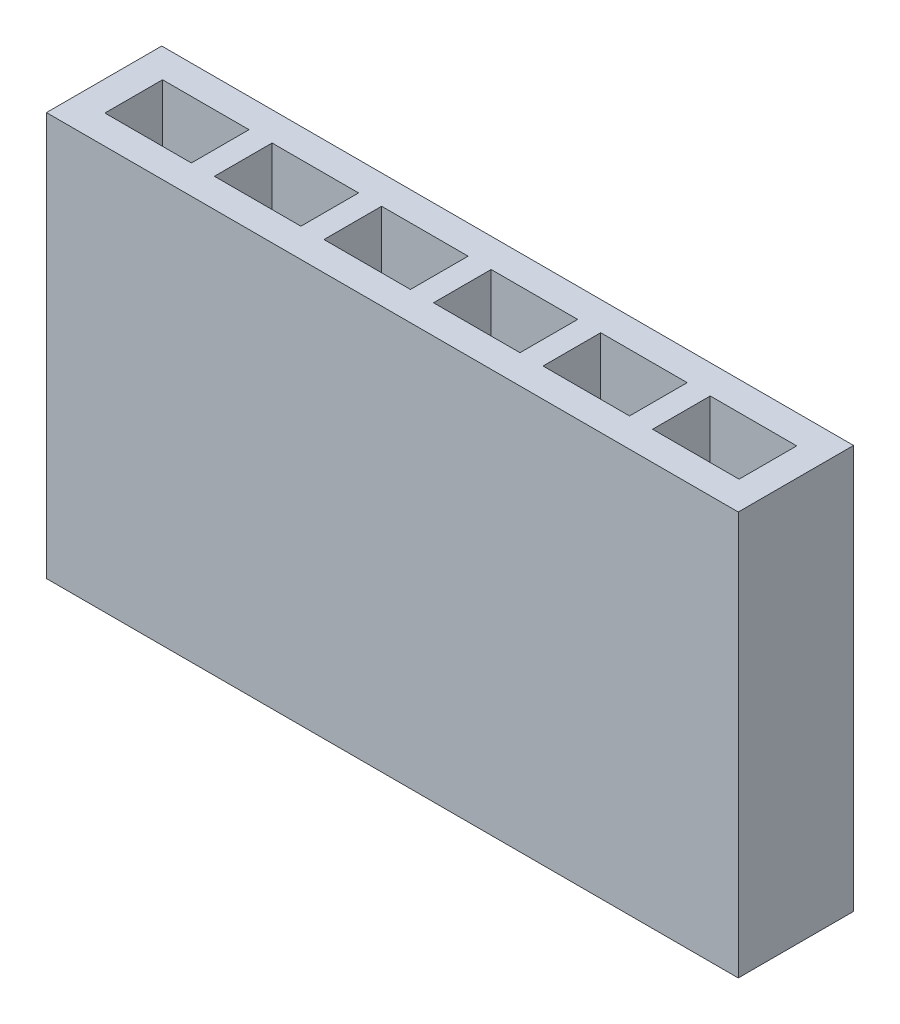
ISO-10303-21;
HEADER;
FILE_DESCRIPTION(('STEP AP214'),'2;1');
FILE_NAME('part.step','',(''),(''),'','','');
FILE_SCHEMA(('AUTOMOTIVE_DESIGN { 1 0 10303 214 1 1 1 1 }'));
ENDSEC;
DATA;
#1=APPLICATION_CONTEXT('core data for automotive mechanical design processes');
#2=APPLICATION_PROTOCOL_DEFINITION('international standard','automotive_design',2000,#1);
#3=PRODUCT_CONTEXT('',#1,'mechanical');
#4=PRODUCT('Part','Part','',(#3));
#5=PRODUCT_RELATED_PRODUCT_CATEGORY('part','',(#4));
#6=PRODUCT_DEFINITION_FORMATION('','',#4);
#7=PRODUCT_DEFINITION_CONTEXT('part definition',#1,'design');
#8=PRODUCT_DEFINITION('design','',#6,#7);
#9=PRODUCT_DEFINITION_SHAPE('','',#8);
#10=(LENGTH_UNIT() NAMED_UNIT(*) SI_UNIT(.MILLI.,.METRE.));
#11=(NAMED_UNIT(*) PLANE_ANGLE_UNIT() SI_UNIT($,.RADIAN.));
#12=(NAMED_UNIT(*) SI_UNIT($,.STERADIAN.) SOLID_ANGLE_UNIT());
#13=UNCERTAINTY_MEASURE_WITH_UNIT(LENGTH_MEASURE(1.E-05),#10,'distance_accuracy_value','');
#14=(GEOMETRIC_REPRESENTATION_CONTEXT(3) GLOBAL_UNCERTAINTY_ASSIGNED_CONTEXT((#13)) GLOBAL_UNIT_ASSIGNED_CONTEXT((#10,
#11,#12)) REPRESENTATION_CONTEXT('',''));
#15=CARTESIAN_POINT('',(0.,0.,0.));
#16=DIRECTION('',(0.,0.,1.));
#17=DIRECTION('',(1.,0.,0.));
#18=AXIS2_PLACEMENT_3D('',#15,#16,#17);
#19=CARTESIAN_POINT('',(0.,0.,2.));
#20=DIRECTION('',(1.,0.,0.));
#21=DIRECTION('',(0.,0.,-1.));
#22=AXIS2_PLACEMENT_3D('',#19,#20,#21);
#23=PLANE('',#22);
#24=DIRECTION('',(0.,-1.,0.));
#25=VECTOR('',#24,1.);
#26=CARTESIAN_POINT('',(0.,0.,0.));
#27=LINE('',#26,#25);
#28=CARTESIAN_POINT('',(0.,7.,0.));
#29=VERTEX_POINT('',#28);
#30=CARTESIAN_POINT('',(0.,0.,0.));
#31=VERTEX_POINT('',#30);
#32=EDGE_CURVE('E286',#29,#31,#27,.T.);
#33=ORIENTED_EDGE('',*,*,#32,.T.);
#34=DIRECTION('',(0.,0.,-1.));
#35=VECTOR('',#34,1.);
#36=CARTESIAN_POINT('',(0.,0.,2.));
#37=LINE('',#36,#35);
#38=CARTESIAN_POINT('',(0.,0.,2.));
#39=VERTEX_POINT('',#38);
#40=EDGE_CURVE('E319',#39,#31,#37,.T.);
#41=ORIENTED_EDGE('',*,*,#40,.F.);
#42=DIRECTION('',(0.,-1.,0.));
#43=VECTOR('',#42,1.);
#44=CARTESIAN_POINT('',(0.,0.,2.));
#45=LINE('',#44,#43);
#46=CARTESIAN_POINT('',(0.,7.,2.));
#47=VERTEX_POINT('',#46);
#48=EDGE_CURVE('E293',#47,#39,#45,.T.);
#49=ORIENTED_EDGE('',*,*,#48,.F.);
#50=DIRECTION('',(0.,0.,-1.));
#51=VECTOR('',#50,1.);
#52=CARTESIAN_POINT('',(0.,7.,2.));
#53=LINE('',#52,#51);
#54=EDGE_CURVE('E303',#47,#29,#53,.T.);
#55=ORIENTED_EDGE('',*,*,#54,.T.);
#56=EDGE_LOOP('',(#33,#41,#49,#55));
#57=FACE_BOUND('',#56,.T.);
#58=ADVANCED_FACE('F33',(#57),#23,.F.);
#59=CARTESIAN_POINT('',(0.,0.,2.));
#60=DIRECTION('',(0.,1.,0.));
#61=DIRECTION('',(0.,0.,1.));
#62=AXIS2_PLACEMENT_3D('',#59,#60,#61);
#63=PLANE('',#62);
#64=DIRECTION('',(1.,0.,0.));
#65=VECTOR('',#64,1.);
#66=CARTESIAN_POINT('',(0.,0.,0.));
#67=LINE('',#66,#65);
#68=CARTESIAN_POINT('',(12.,0.,0.));
#69=VERTEX_POINT('',#68);
#70=EDGE_CURVE('E306',#31,#69,#67,.T.);
#71=ORIENTED_EDGE('',*,*,#70,.T.);
#72=DIRECTION('',(0.,0.,-1.));
#73=VECTOR('',#72,1.);
#74=CARTESIAN_POINT('',(12.,0.,2.));
#75=LINE('',#74,#73);
#76=CARTESIAN_POINT('',(12.,0.,2.));
#77=VERTEX_POINT('',#76);
#78=EDGE_CURVE('E316',#77,#69,#75,.T.);
#79=ORIENTED_EDGE('',*,*,#78,.F.);
#80=DIRECTION('',(1.,0.,0.));
#81=VECTOR('',#80,1.);
#82=CARTESIAN_POINT('',(0.,0.,2.));
#83=LINE('',#82,#81);
#84=EDGE_CURVE('E296',#39,#77,#83,.T.);
#85=ORIENTED_EDGE('',*,*,#84,.F.);
#86=ORIENTED_EDGE('',*,*,#40,.T.);
#87=EDGE_LOOP('',(#71,#79,#85,#86));
#88=FACE_BOUND('',#87,.T.);
#89=ADVANCED_FACE('F473',(#88),#63,.F.);
#90=CARTESIAN_POINT('',(12.,0.,2.));
#91=DIRECTION('',(-1.,0.,0.));
#92=DIRECTION('',(0.,0.,1.));
#93=AXIS2_PLACEMENT_3D('',#90,#91,#92);
#94=PLANE('',#93);
#95=DIRECTION('',(0.,1.,0.));
#96=VECTOR('',#95,1.);
#97=CARTESIAN_POINT('',(12.,0.,0.));
#98=LINE('',#97,#96);
#99=CARTESIAN_POINT('',(12.,7.,0.));
#100=VERTEX_POINT('',#99);
#101=EDGE_CURVE('E308',#69,#100,#98,.T.);
#102=ORIENTED_EDGE('',*,*,#101,.T.);
#103=DIRECTION('',(0.,0.,-1.));
#104=VECTOR('',#103,1.);
#105=CARTESIAN_POINT('',(12.,7.,2.));
#106=LINE('',#105,#104);
#107=CARTESIAN_POINT('',(12.,7.,2.));
#108=VERTEX_POINT('',#107);
#109=EDGE_CURVE('E313',#108,#100,#106,.T.);
#110=ORIENTED_EDGE('',*,*,#109,.F.);
#111=DIRECTION('',(0.,1.,0.));
#112=VECTOR('',#111,1.);
#113=CARTESIAN_POINT('',(12.,0.,2.));
#114=LINE('',#113,#112);
#115=EDGE_CURVE('E299',#77,#108,#114,.T.);
#116=ORIENTED_EDGE('',*,*,#115,.F.);
#117=ORIENTED_EDGE('',*,*,#78,.T.);
#118=EDGE_LOOP('',(#102,#110,#116,#117));
#119=FACE_BOUND('',#118,.T.);
#120=ADVANCED_FACE('F463',(#119),#94,.F.);
#121=CARTESIAN_POINT('',(0.,7.,2.));
#122=DIRECTION('',(0.,-1.,0.));
#123=DIRECTION('',(0.,0.,-1.));
#124=AXIS2_PLACEMENT_3D('',#121,#122,#123);
#125=PLANE('',#124);
#126=DIRECTION('',(1.,0.,0.));
#127=VECTOR('',#126,1.);
#128=CARTESIAN_POINT('',(2.41393860839303,7.,1.5));
#129=LINE('',#128,#127);
#130=CARTESIAN_POINT('',(2.41393860839303,7.,1.5));
#131=VERTEX_POINT('',#130);
#132=CARTESIAN_POINT('',(3.91393860839303,7.,1.5));
#133=VERTEX_POINT('',#132);
#134=EDGE_CURVE('E231',#131,#133,#129,.T.);
#135=ORIENTED_EDGE('',*,*,#134,.F.);
#136=DIRECTION('',(0.,0.,1.));
#137=VECTOR('',#136,1.);
#138=CARTESIAN_POINT('',(2.41393860839303,7.,0.5));
#139=LINE('',#138,#137);
#140=CARTESIAN_POINT('',(2.41393860839303,7.,0.5));
#141=VERTEX_POINT('',#140);
#142=EDGE_CURVE('E245',#141,#131,#139,.T.);
#143=ORIENTED_EDGE('',*,*,#142,.F.);
#144=DIRECTION('',(-1.,0.,0.));
#145=VECTOR('',#144,1.);
#146=CARTESIAN_POINT('',(2.41393860839303,7.,0.5));
#147=LINE('',#146,#145);
#148=CARTESIAN_POINT('',(3.91393860839303,7.,0.5));
#149=VERTEX_POINT('',#148);
#150=EDGE_CURVE('E255',#149,#141,#147,.T.);
#151=ORIENTED_EDGE('',*,*,#150,.F.);
#152=DIRECTION('',(0.,0.,-1.));
#153=VECTOR('',#152,1.);
#154=CARTESIAN_POINT('',(3.91393860839303,7.,0.5));
#155=LINE('',#154,#153);
#156=EDGE_CURVE('E246',#133,#149,#155,.T.);
#157=ORIENTED_EDGE('',*,*,#156,.F.);
#158=EDGE_LOOP('',(#135,#143,#151,#157));
#159=FACE_BOUND('',#158,.T.);
#160=DIRECTION('',(1.,0.,0.));
#161=VECTOR('',#160,1.);
#162=CARTESIAN_POINT('',(0.513938608393032,7.,1.5));
#163=LINE('',#162,#161);
#164=CARTESIAN_POINT('',(0.513938608393032,7.,1.5));
#165=VERTEX_POINT('',#164);
#166=CARTESIAN_POINT('',(2.01393860839303,7.,1.5));
#167=VERTEX_POINT('',#166);
#168=EDGE_CURVE('E276',#165,#167,#163,.T.);
#169=ORIENTED_EDGE('',*,*,#168,.F.);
#170=DIRECTION('',(0.,0.,1.));
#171=VECTOR('',#170,1.);
#172=CARTESIAN_POINT('',(0.513938608393032,7.,0.5));
#173=LINE('',#172,#171);
#174=CARTESIAN_POINT('',(0.513938608393032,7.,0.5));
#175=VERTEX_POINT('',#174);
#176=EDGE_CURVE('E260',#175,#165,#173,.T.);
#177=ORIENTED_EDGE('',*,*,#176,.F.);
#178=DIRECTION('',(-1.,0.,0.));
#179=VECTOR('',#178,1.);
#180=CARTESIAN_POINT('',(0.513938608393032,7.,0.5));
#181=LINE('',#180,#179);
#182=CARTESIAN_POINT('',(2.01393860839303,7.,0.5));
#183=VERTEX_POINT('',#182);
#184=EDGE_CURVE('E265',#183,#175,#181,.T.);
#185=ORIENTED_EDGE('',*,*,#184,.F.);
#186=DIRECTION('',(0.,0.,-1.));
#187=VECTOR('',#186,1.);
#188=CARTESIAN_POINT('',(2.01393860839303,7.,0.5));
#189=LINE('',#188,#187);
#190=EDGE_CURVE('E279',#167,#183,#189,.T.);
#191=ORIENTED_EDGE('',*,*,#190,.F.);
#192=EDGE_LOOP('',(#169,#177,#185,#191));
#193=FACE_BOUND('',#192,.T.);
#194=DIRECTION('',(-1.,0.,0.));
#195=VECTOR('',#194,1.);
#196=CARTESIAN_POINT('',(0.,7.,0.));
#197=LINE('',#196,#195);
#198=EDGE_CURVE('E297',#100,#29,#197,.T.);
#199=ORIENTED_EDGE('',*,*,#198,.T.);
#200=ORIENTED_EDGE('',*,*,#54,.F.);
#201=DIRECTION('',(-1.,0.,0.));
#202=VECTOR('',#201,1.);
#203=CARTESIAN_POINT('',(0.,7.,2.));
#204=LINE('',#203,#202);
#205=EDGE_CURVE('E301',#108,#47,#204,.T.);
#206=ORIENTED_EDGE('',*,*,#205,.F.);
#207=ORIENTED_EDGE('',*,*,#109,.T.);
#208=EDGE_LOOP('',(#199,#200,#206,#207));
#209=FACE_BOUND('',#208,.T.);
#210=DIRECTION('',(0.,0.,1.));
#211=VECTOR('',#210,1.);
#212=CARTESIAN_POINT('',(4.31393860839303,7.,0.5));
#213=LINE('',#212,#211);
#214=CARTESIAN_POINT('',(4.31393860839303,7.,0.5));
#215=VERTEX_POINT('',#214);
#216=CARTESIAN_POINT('',(4.31393860839303,7.,1.5));
#217=VERTEX_POINT('',#216);
#218=EDGE_CURVE('E322',#215,#217,#213,.T.);
#219=ORIENTED_EDGE('',*,*,#218,.F.);
#220=DIRECTION('',(-1.,0.,0.));
#221=VECTOR('',#220,1.);
#222=CARTESIAN_POINT('',(4.31393860839303,7.,0.5));
#223=LINE('',#222,#221);
#224=CARTESIAN_POINT('',(5.81393860839303,7.,0.5));
#225=VERTEX_POINT('',#224);
#226=EDGE_CURVE('E324',#225,#215,#223,.T.);
#227=ORIENTED_EDGE('',*,*,#226,.F.);
#228=DIRECTION('',(0.,0.,-1.));
#229=VECTOR('',#228,1.);
#230=CARTESIAN_POINT('',(5.81393860839303,7.,0.5));
#231=LINE('',#230,#229);
#232=CARTESIAN_POINT('',(5.81393860839303,7.,1.5));
#233=VERTEX_POINT('',#232);
#234=EDGE_CURVE('E327',#233,#225,#231,.T.);
#235=ORIENTED_EDGE('',*,*,#234,.F.);
#236=DIRECTION('',(1.,0.,0.));
#237=VECTOR('',#236,1.);
#238=CARTESIAN_POINT('',(4.31393860839303,7.,1.5));
#239=LINE('',#238,#237);
#240=EDGE_CURVE('E330',#217,#233,#239,.T.);
#241=ORIENTED_EDGE('',*,*,#240,.F.);
#242=EDGE_LOOP('',(#219,#227,#235,#241));
#243=FACE_BOUND('',#242,.T.);
#244=DIRECTION('',(0.,0.,1.));
#245=VECTOR('',#244,1.);
#246=CARTESIAN_POINT('',(6.21393860839303,7.,0.5));
#247=LINE('',#246,#245);
#248=CARTESIAN_POINT('',(6.21393860839303,7.,0.5));
#249=VERTEX_POINT('',#248);
#250=CARTESIAN_POINT('',(6.21393860839303,7.,1.5));
#251=VERTEX_POINT('',#250);
#252=EDGE_CURVE('E357',#249,#251,#247,.T.);
#253=ORIENTED_EDGE('',*,*,#252,.F.);
#254=DIRECTION('',(-1.,0.,0.));
#255=VECTOR('',#254,1.);
#256=CARTESIAN_POINT('',(6.21393860839303,7.,0.5));
#257=LINE('',#256,#255);
#258=CARTESIAN_POINT('',(7.71393860839303,7.,0.5));
#259=VERTEX_POINT('',#258);
#260=EDGE_CURVE('E359',#259,#249,#257,.T.);
#261=ORIENTED_EDGE('',*,*,#260,.F.);
#262=DIRECTION('',(0.,0.,-1.));
#263=VECTOR('',#262,1.);
#264=CARTESIAN_POINT('',(7.71393860839303,7.,0.5));
#265=LINE('',#264,#263);
#266=CARTESIAN_POINT('',(7.71393860839303,7.,1.5));
#267=VERTEX_POINT('',#266);
#268=EDGE_CURVE('E362',#267,#259,#265,.T.);
#269=ORIENTED_EDGE('',*,*,#268,.F.);
#270=DIRECTION('',(1.,0.,0.));
#271=VECTOR('',#270,1.);
#272=CARTESIAN_POINT('',(6.21393860839303,7.,1.5));
#273=LINE('',#272,#271);
#274=EDGE_CURVE('E365',#251,#267,#273,.T.);
#275=ORIENTED_EDGE('',*,*,#274,.F.);
#276=EDGE_LOOP('',(#253,#261,#269,#275));
#277=FACE_BOUND('',#276,.T.);
#278=DIRECTION('',(0.,0.,1.));
#279=VECTOR('',#278,1.);
#280=CARTESIAN_POINT('',(8.11393860839303,7.,0.5));
#281=LINE('',#280,#279);
#282=CARTESIAN_POINT('',(8.11393860839303,7.,0.5));
#283=VERTEX_POINT('',#282);
#284=CARTESIAN_POINT('',(8.11393860839303,7.,1.5));
#285=VERTEX_POINT('',#284);
#286=EDGE_CURVE('E392',#283,#285,#281,.T.);
#287=ORIENTED_EDGE('',*,*,#286,.F.);
#288=DIRECTION('',(-1.,0.,0.));
#289=VECTOR('',#288,1.);
#290=CARTESIAN_POINT('',(8.11393860839303,7.,0.5));
#291=LINE('',#290,#289);
#292=CARTESIAN_POINT('',(9.61393860839303,7.,0.5));
#293=VERTEX_POINT('',#292);
#294=EDGE_CURVE('E394',#293,#283,#291,.T.);
#295=ORIENTED_EDGE('',*,*,#294,.F.);
#296=DIRECTION('',(0.,0.,-1.));
#297=VECTOR('',#296,1.);
#298=CARTESIAN_POINT('',(9.61393860839303,7.,0.5));
#299=LINE('',#298,#297);
#300=CARTESIAN_POINT('',(9.61393860839303,7.,1.5));
#301=VERTEX_POINT('',#300);
#302=EDGE_CURVE('E397',#301,#293,#299,.T.);
#303=ORIENTED_EDGE('',*,*,#302,.F.);
#304=DIRECTION('',(1.,0.,0.));
#305=VECTOR('',#304,1.);
#306=CARTESIAN_POINT('',(8.11393860839303,7.,1.5));
#307=LINE('',#306,#305);
#308=EDGE_CURVE('E400',#285,#301,#307,.T.);
#309=ORIENTED_EDGE('',*,*,#308,.F.);
#310=EDGE_LOOP('',(#287,#295,#303,#309));
#311=FACE_BOUND('',#310,.T.);
#312=DIRECTION('',(0.,0.,1.));
#313=VECTOR('',#312,1.);
#314=CARTESIAN_POINT('',(10.013938608393,7.,0.5));
#315=LINE('',#314,#313);
#316=CARTESIAN_POINT('',(10.013938608393,7.,0.5));
#317=VERTEX_POINT('',#316);
#318=CARTESIAN_POINT('',(10.013938608393,7.,1.5));
#319=VERTEX_POINT('',#318);
#320=EDGE_CURVE('E427',#317,#319,#315,.T.);
#321=ORIENTED_EDGE('',*,*,#320,.F.);
#322=DIRECTION('',(-1.,0.,0.));
#323=VECTOR('',#322,1.);
#324=CARTESIAN_POINT('',(10.013938608393,7.,0.5));
#325=LINE('',#324,#323);
#326=CARTESIAN_POINT('',(11.513938608393,7.,0.5));
#327=VERTEX_POINT('',#326);
#328=EDGE_CURVE('E429',#327,#317,#325,.T.);
#329=ORIENTED_EDGE('',*,*,#328,.F.);
#330=DIRECTION('',(0.,0.,-1.));
#331=VECTOR('',#330,1.);
#332=CARTESIAN_POINT('',(11.513938608393,7.,0.5));
#333=LINE('',#332,#331);
#334=CARTESIAN_POINT('',(11.513938608393,7.,1.5));
#335=VERTEX_POINT('',#334);
#336=EDGE_CURVE('E432',#335,#327,#333,.T.);
#337=ORIENTED_EDGE('',*,*,#336,.F.);
#338=DIRECTION('',(1.,0.,0.));
#339=VECTOR('',#338,1.);
#340=CARTESIAN_POINT('',(10.013938608393,7.,1.5));
#341=LINE('',#340,#339);
#342=EDGE_CURVE('E435',#319,#335,#341,.T.);
#343=ORIENTED_EDGE('',*,*,#342,.F.);
#344=EDGE_LOOP('',(#321,#329,#337,#343));
#345=FACE_BOUND('',#344,.T.);
#346=ADVANCED_FACE('F460',(#159,#193,#209,#243,#277,#311,#345),#125,.F.);
#347=CARTESIAN_POINT('',(0.,0.,2.));
#348=DIRECTION('',(0.,0.,-1.));
#349=DIRECTION('',(-1.,0.,0.));
#350=AXIS2_PLACEMENT_3D('',#347,#348,#349);
#351=PLANE('',#350);
#352=ORIENTED_EDGE('',*,*,#48,.T.);
#353=ORIENTED_EDGE('',*,*,#84,.T.);
#354=ORIENTED_EDGE('',*,*,#115,.T.);
#355=ORIENTED_EDGE('',*,*,#205,.T.);
#356=EDGE_LOOP('',(#352,#353,#354,#355));
#357=FACE_BOUND('',#356,.T.);
#358=ADVANCED_FACE('F462',(#357),#351,.F.);
#359=CARTESIAN_POINT('',(0.,0.,0.));
#360=DIRECTION('',(0.,0.,-1.));
#361=DIRECTION('',(-1.,0.,0.));
#362=AXIS2_PLACEMENT_3D('',#359,#360,#361);
#363=PLANE('',#362);
#364=ORIENTED_EDGE('',*,*,#32,.F.);
#365=ORIENTED_EDGE('',*,*,#198,.F.);
#366=ORIENTED_EDGE('',*,*,#101,.F.);
#367=ORIENTED_EDGE('',*,*,#70,.F.);
#368=EDGE_LOOP('',(#364,#365,#366,#367));
#369=FACE_BOUND('',#368,.T.);
#370=ADVANCED_FACE('F470',(#369),#363,.T.);
#371=CARTESIAN_POINT('',(0.513938608393032,3.,0.5));
#372=DIRECTION('',(-1.,0.,0.));
#373=DIRECTION('',(0.,0.,1.));
#374=AXIS2_PLACEMENT_3D('',#371,#372,#373);
#375=PLANE('',#374);
#376=ORIENTED_EDGE('',*,*,#176,.T.);
#377=DIRECTION('',(0.,1.,0.));
#378=VECTOR('',#377,1.);
#379=CARTESIAN_POINT('',(0.513938608393032,3.,1.5));
#380=LINE('',#379,#378);
#381=CARTESIAN_POINT('',(0.513938608393032,3.,1.5));
#382=VERTEX_POINT('',#381);
#383=EDGE_CURVE('E274',#382,#165,#380,.T.);
#384=ORIENTED_EDGE('',*,*,#383,.F.);
#385=DIRECTION('',(0.,0.,1.));
#386=VECTOR('',#385,1.);
#387=CARTESIAN_POINT('',(0.513938608393032,3.,0.5));
#388=LINE('',#387,#386);
#389=CARTESIAN_POINT('',(0.513938608393032,3.,0.5));
#390=VERTEX_POINT('',#389);
#391=EDGE_CURVE('E261',#390,#382,#388,.T.);
#392=ORIENTED_EDGE('',*,*,#391,.F.);
#393=DIRECTION('',(0.,1.,0.));
#394=VECTOR('',#393,1.);
#395=CARTESIAN_POINT('',(0.513938608393032,3.,0.5));
#396=LINE('',#395,#394);
#397=EDGE_CURVE('E284',#390,#175,#396,.T.);
#398=ORIENTED_EDGE('',*,*,#397,.T.);
#399=EDGE_LOOP('',(#376,#384,#392,#398));
#400=FACE_BOUND('',#399,.T.);
#401=ADVANCED_FACE('F683',(#400),#375,.F.);
#402=CARTESIAN_POINT('',(0.513938608393032,3.,0.5));
#403=DIRECTION('',(0.,0.,-1.));
#404=DIRECTION('',(-1.,0.,0.));
#405=AXIS2_PLACEMENT_3D('',#402,#403,#404);
#406=PLANE('',#405);
#407=ORIENTED_EDGE('',*,*,#184,.T.);
#408=ORIENTED_EDGE('',*,*,#397,.F.);
#409=DIRECTION('',(-1.,0.,0.));
#410=VECTOR('',#409,1.);
#411=CARTESIAN_POINT('',(0.513938608393032,3.,0.5));
#412=LINE('',#411,#410);
#413=CARTESIAN_POINT('',(2.01393860839303,3.,0.5));
#414=VERTEX_POINT('',#413);
#415=EDGE_CURVE('E271',#414,#390,#412,.T.);
#416=ORIENTED_EDGE('',*,*,#415,.F.);
#417=DIRECTION('',(0.,1.,0.));
#418=VECTOR('',#417,1.);
#419=CARTESIAN_POINT('',(2.01393860839303,3.,0.5));
#420=LINE('',#419,#418);
#421=EDGE_CURVE('E287',#414,#183,#420,.T.);
#422=ORIENTED_EDGE('',*,*,#421,.T.);
#423=EDGE_LOOP('',(#407,#408,#416,#422));
#424=FACE_BOUND('',#423,.T.);
#425=ADVANCED_FACE('F675',(#424),#406,.F.);
#426=CARTESIAN_POINT('',(2.01393860839303,3.,0.5));
#427=DIRECTION('',(1.,0.,0.));
#428=DIRECTION('',(0.,0.,-1.));
#429=AXIS2_PLACEMENT_3D('',#426,#427,#428);
#430=PLANE('',#429);
#431=ORIENTED_EDGE('',*,*,#190,.T.);
#432=ORIENTED_EDGE('',*,*,#421,.F.);
#433=DIRECTION('',(0.,0.,-1.));
#434=VECTOR('',#433,1.);
#435=CARTESIAN_POINT('',(2.01393860839303,3.,0.5));
#436=LINE('',#435,#434);
#437=CARTESIAN_POINT('',(2.01393860839303,3.,1.5));
#438=VERTEX_POINT('',#437);
#439=EDGE_CURVE('E268',#438,#414,#436,.T.);
#440=ORIENTED_EDGE('',*,*,#439,.F.);
#441=DIRECTION('',(0.,1.,0.));
#442=VECTOR('',#441,1.);
#443=CARTESIAN_POINT('',(2.01393860839303,3.,1.5));
#444=LINE('',#443,#442);
#445=EDGE_CURVE('E289',#438,#167,#444,.T.);
#446=ORIENTED_EDGE('',*,*,#445,.T.);
#447=EDGE_LOOP('',(#431,#432,#440,#446));
#448=FACE_BOUND('',#447,.T.);
#449=ADVANCED_FACE('F667',(#448),#430,.F.);
#450=CARTESIAN_POINT('',(0.513938608393032,3.,1.5));
#451=DIRECTION('',(0.,0.,1.));
#452=DIRECTION('',(1.,0.,0.));
#453=AXIS2_PLACEMENT_3D('',#450,#451,#452);
#454=PLANE('',#453);
#455=ORIENTED_EDGE('',*,*,#168,.T.);
#456=ORIENTED_EDGE('',*,*,#445,.F.);
#457=DIRECTION('',(1.,0.,0.));
#458=VECTOR('',#457,1.);
#459=CARTESIAN_POINT('',(0.513938608393032,3.,1.5));
#460=LINE('',#459,#458);
#461=EDGE_CURVE('E264',#382,#438,#460,.T.);
#462=ORIENTED_EDGE('',*,*,#461,.F.);
#463=ORIENTED_EDGE('',*,*,#383,.T.);
#464=EDGE_LOOP('',(#455,#456,#462,#463));
#465=FACE_BOUND('',#464,.T.);
#466=ADVANCED_FACE('F659',(#465),#454,.F.);
#467=CARTESIAN_POINT('',(0.,3.,0.));
#468=DIRECTION('',(0.,1.,0.));
#469=DIRECTION('',(0.,0.,1.));
#470=AXIS2_PLACEMENT_3D('',#467,#468,#469);
#471=PLANE('',#470);
#472=ORIENTED_EDGE('',*,*,#391,.T.);
#473=ORIENTED_EDGE('',*,*,#461,.T.);
#474=ORIENTED_EDGE('',*,*,#439,.T.);
#475=ORIENTED_EDGE('',*,*,#415,.T.);
#476=EDGE_LOOP('',(#472,#473,#474,#475));
#477=FACE_BOUND('',#476,.T.);
#478=ADVANCED_FACE('F652',(#477),#471,.T.);
#479=CARTESIAN_POINT('',(2.41393860839303,3.,0.5));
#480=DIRECTION('',(-1.,0.,0.));
#481=DIRECTION('',(0.,0.,1.));
#482=AXIS2_PLACEMENT_3D('',#479,#480,#481);
#483=PLANE('',#482);
#484=ORIENTED_EDGE('',*,*,#142,.T.);
#485=DIRECTION('',(0.,1.,0.));
#486=VECTOR('',#485,1.);
#487=CARTESIAN_POINT('',(2.41393860839303,3.,1.5));
#488=LINE('',#487,#486);
#489=CARTESIAN_POINT('',(2.41393860839303,3.,1.5));
#490=VERTEX_POINT('',#489);
#491=EDGE_CURVE('E237',#490,#131,#488,.T.);
#492=ORIENTED_EDGE('',*,*,#491,.F.);
#493=DIRECTION('',(0.,0.,1.));
#494=VECTOR('',#493,1.);
#495=CARTESIAN_POINT('',(2.41393860839303,3.,0.5));
#496=LINE('',#495,#494);
#497=CARTESIAN_POINT('',(2.41393860839303,3.,0.5));
#498=VERTEX_POINT('',#497);
#499=EDGE_CURVE('E220',#498,#490,#496,.T.);
#500=ORIENTED_EDGE('',*,*,#499,.F.);
#501=DIRECTION('',(0.,1.,0.));
#502=VECTOR('',#501,1.);
#503=CARTESIAN_POINT('',(2.41393860839303,3.,0.5));
#504=LINE('',#503,#502);
#505=EDGE_CURVE('E257',#498,#141,#504,.T.);
#506=ORIENTED_EDGE('',*,*,#505,.T.);
#507=EDGE_LOOP('',(#484,#492,#500,#506));
#508=FACE_BOUND('',#507,.T.);
#509=ADVANCED_FACE('F243',(#508),#483,.F.);
#510=CARTESIAN_POINT('',(2.41393860839303,3.,0.5));
#511=DIRECTION('',(0.,0.,-1.));
#512=DIRECTION('',(-1.,0.,0.));
#513=AXIS2_PLACEMENT_3D('',#510,#511,#512);
#514=PLANE('',#513);
#515=ORIENTED_EDGE('',*,*,#150,.T.);
#516=ORIENTED_EDGE('',*,*,#505,.F.);
#517=DIRECTION('',(-1.,0.,0.));
#518=VECTOR('',#517,1.);
#519=CARTESIAN_POINT('',(2.41393860839303,3.,0.5));
#520=LINE('',#519,#518);
#521=CARTESIAN_POINT('',(3.91393860839303,3.,0.5));
#522=VERTEX_POINT('',#521);
#523=EDGE_CURVE('E226',#522,#498,#520,.T.);
#524=ORIENTED_EDGE('',*,*,#523,.F.);
#525=DIRECTION('',(0.,1.,0.));
#526=VECTOR('',#525,1.);
#527=CARTESIAN_POINT('',(3.91393860839303,3.,0.5));
#528=LINE('',#527,#526);
#529=EDGE_CURVE('E248',#522,#149,#528,.T.);
#530=ORIENTED_EDGE('',*,*,#529,.T.);
#531=EDGE_LOOP('',(#515,#516,#524,#530));
#532=FACE_BOUND('',#531,.T.);
#533=ADVANCED_FACE('F637',(#532),#514,.F.);
#534=CARTESIAN_POINT('',(3.91393860839303,3.,0.5));
#535=DIRECTION('',(1.,0.,0.));
#536=DIRECTION('',(0.,0.,-1.));
#537=AXIS2_PLACEMENT_3D('',#534,#535,#536);
#538=PLANE('',#537);
#539=ORIENTED_EDGE('',*,*,#156,.T.);
#540=ORIENTED_EDGE('',*,*,#529,.F.);
#541=DIRECTION('',(0.,0.,-1.));
#542=VECTOR('',#541,1.);
#543=CARTESIAN_POINT('',(3.91393860839303,3.,0.5));
#544=LINE('',#543,#542);
#545=CARTESIAN_POINT('',(3.91393860839303,3.,1.5));
#546=VERTEX_POINT('',#545);
#547=EDGE_CURVE('E241',#546,#522,#544,.T.);
#548=ORIENTED_EDGE('',*,*,#547,.F.);
#549=DIRECTION('',(0.,1.,0.));
#550=VECTOR('',#549,1.);
#551=CARTESIAN_POINT('',(3.91393860839303,3.,1.5));
#552=LINE('',#551,#550);
#553=EDGE_CURVE('E240',#546,#133,#552,.T.);
#554=ORIENTED_EDGE('',*,*,#553,.T.);
#555=EDGE_LOOP('',(#539,#540,#548,#554));
#556=FACE_BOUND('',#555,.T.);
#557=ADVANCED_FACE('F630',(#556),#538,.F.);
#558=CARTESIAN_POINT('',(2.41393860839303,3.,1.5));
#559=DIRECTION('',(0.,0.,1.));
#560=DIRECTION('',(1.,0.,0.));
#561=AXIS2_PLACEMENT_3D('',#558,#559,#560);
#562=PLANE('',#561);
#563=ORIENTED_EDGE('',*,*,#134,.T.);
#564=ORIENTED_EDGE('',*,*,#553,.F.);
#565=DIRECTION('',(1.,0.,0.));
#566=VECTOR('',#565,1.);
#567=CARTESIAN_POINT('',(2.41393860839303,3.,1.5));
#568=LINE('',#567,#566);
#569=EDGE_CURVE('E223',#490,#546,#568,.T.);
#570=ORIENTED_EDGE('',*,*,#569,.F.);
#571=ORIENTED_EDGE('',*,*,#491,.T.);
#572=EDGE_LOOP('',(#563,#564,#570,#571));
#573=FACE_BOUND('',#572,.T.);
#574=ADVANCED_FACE('F236',(#573),#562,.F.);
#575=CARTESIAN_POINT('',(1.9,3.,0.));
#576=DIRECTION('',(0.,1.,0.));
#577=DIRECTION('',(0.,0.,1.));
#578=AXIS2_PLACEMENT_3D('',#575,#576,#577);
#579=PLANE('',#578);
#580=ORIENTED_EDGE('',*,*,#499,.T.);
#581=ORIENTED_EDGE('',*,*,#569,.T.);
#582=ORIENTED_EDGE('',*,*,#547,.T.);
#583=ORIENTED_EDGE('',*,*,#523,.T.);
#584=EDGE_LOOP('',(#580,#581,#582,#583));
#585=FACE_BOUND('',#584,.T.);
#586=ADVANCED_FACE('F222',(#585),#579,.T.);
#587=CARTESIAN_POINT('',(3.8,3.,0.));
#588=DIRECTION('',(0.,1.,0.));
#589=DIRECTION('',(0.,0.,1.));
#590=AXIS2_PLACEMENT_3D('',#587,#588,#589);
#591=PLANE('',#590);
#592=DIRECTION('',(0.,0.,1.));
#593=VECTOR('',#592,1.);
#594=CARTESIAN_POINT('',(4.31393860839303,3.,0.5));
#595=LINE('',#594,#593);
#596=CARTESIAN_POINT('',(4.31393860839303,3.,0.5));
#597=VERTEX_POINT('',#596);
#598=CARTESIAN_POINT('',(4.31393860839303,3.,1.5));
#599=VERTEX_POINT('',#598);
#600=EDGE_CURVE('E336',#597,#599,#595,.T.);
#601=ORIENTED_EDGE('',*,*,#600,.T.);
#602=DIRECTION('',(1.,0.,0.));
#603=VECTOR('',#602,1.);
#604=CARTESIAN_POINT('',(4.31393860839303,3.,1.5));
#605=LINE('',#604,#603);
#606=CARTESIAN_POINT('',(5.81393860839303,3.,1.5));
#607=VERTEX_POINT('',#606);
#608=EDGE_CURVE('E354',#599,#607,#605,.T.);
#609=ORIENTED_EDGE('',*,*,#608,.T.);
#610=DIRECTION('',(0.,0.,-1.));
#611=VECTOR('',#610,1.);
#612=CARTESIAN_POINT('',(5.81393860839303,3.,0.5));
#613=LINE('',#612,#611);
#614=CARTESIAN_POINT('',(5.81393860839303,3.,0.5));
#615=VERTEX_POINT('',#614);
#616=EDGE_CURVE('E348',#607,#615,#613,.T.);
#617=ORIENTED_EDGE('',*,*,#616,.T.);
#618=DIRECTION('',(-1.,0.,0.));
#619=VECTOR('',#618,1.);
#620=CARTESIAN_POINT('',(4.31393860839303,3.,0.5));
#621=LINE('',#620,#619);
#622=EDGE_CURVE('E342',#615,#597,#621,.T.);
#623=ORIENTED_EDGE('',*,*,#622,.T.);
#624=EDGE_LOOP('',(#601,#609,#617,#623));
#625=FACE_BOUND('',#624,.T.);
#626=ADVANCED_FACE('F503',(#625),#591,.T.);
#627=CARTESIAN_POINT('',(4.31393860839303,3.,1.5));
#628=DIRECTION('',(0.,0.,1.));
#629=DIRECTION('',(1.,0.,0.));
#630=AXIS2_PLACEMENT_3D('',#627,#628,#629);
#631=PLANE('',#630);
#632=ORIENTED_EDGE('',*,*,#240,.T.);
#633=DIRECTION('',(0.,1.,0.));
#634=VECTOR('',#633,1.);
#635=CARTESIAN_POINT('',(5.81393860839303,3.,1.5));
#636=LINE('',#635,#634);
#637=EDGE_CURVE('E351',#607,#233,#636,.T.);
#638=ORIENTED_EDGE('',*,*,#637,.F.);
#639=ORIENTED_EDGE('',*,*,#608,.F.);
#640=DIRECTION('',(0.,1.,0.));
#641=VECTOR('',#640,1.);
#642=CARTESIAN_POINT('',(4.31393860839303,3.,1.5));
#643=LINE('',#642,#641);
#644=EDGE_CURVE('E333',#599,#217,#643,.T.);
#645=ORIENTED_EDGE('',*,*,#644,.T.);
#646=EDGE_LOOP('',(#632,#638,#639,#645));
#647=FACE_BOUND('',#646,.T.);
#648=ADVANCED_FACE('F499',(#647),#631,.F.);
#649=CARTESIAN_POINT('',(5.81393860839303,3.,0.5));
#650=DIRECTION('',(1.,0.,0.));
#651=DIRECTION('',(0.,0.,-1.));
#652=AXIS2_PLACEMENT_3D('',#649,#650,#651);
#653=PLANE('',#652);
#654=ORIENTED_EDGE('',*,*,#234,.T.);
#655=DIRECTION('',(0.,1.,0.));
#656=VECTOR('',#655,1.);
#657=CARTESIAN_POINT('',(5.81393860839303,3.,0.5));
#658=LINE('',#657,#656);
#659=EDGE_CURVE('E345',#615,#225,#658,.T.);
#660=ORIENTED_EDGE('',*,*,#659,.F.);
#661=ORIENTED_EDGE('',*,*,#616,.F.);
#662=ORIENTED_EDGE('',*,*,#637,.T.);
#663=EDGE_LOOP('',(#654,#660,#661,#662));
#664=FACE_BOUND('',#663,.T.);
#665=ADVANCED_FACE('F495',(#664),#653,.F.);
#666=CARTESIAN_POINT('',(4.31393860839303,3.,0.5));
#667=DIRECTION('',(0.,0.,-1.));
#668=DIRECTION('',(-1.,0.,0.));
#669=AXIS2_PLACEMENT_3D('',#666,#667,#668);
#670=PLANE('',#669);
#671=ORIENTED_EDGE('',*,*,#226,.T.);
#672=DIRECTION('',(0.,1.,0.));
#673=VECTOR('',#672,1.);
#674=CARTESIAN_POINT('',(4.31393860839303,3.,0.5));
#675=LINE('',#674,#673);
#676=EDGE_CURVE('E339',#597,#215,#675,.T.);
#677=ORIENTED_EDGE('',*,*,#676,.F.);
#678=ORIENTED_EDGE('',*,*,#622,.F.);
#679=ORIENTED_EDGE('',*,*,#659,.T.);
#680=EDGE_LOOP('',(#671,#677,#678,#679));
#681=FACE_BOUND('',#680,.T.);
#682=ADVANCED_FACE('F491',(#681),#670,.F.);
#683=CARTESIAN_POINT('',(4.31393860839303,3.,0.5));
#684=DIRECTION('',(-1.,0.,0.));
#685=DIRECTION('',(0.,0.,1.));
#686=AXIS2_PLACEMENT_3D('',#683,#684,#685);
#687=PLANE('',#686);
#688=ORIENTED_EDGE('',*,*,#218,.T.);
#689=ORIENTED_EDGE('',*,*,#644,.F.);
#690=ORIENTED_EDGE('',*,*,#600,.F.);
#691=ORIENTED_EDGE('',*,*,#676,.T.);
#692=EDGE_LOOP('',(#688,#689,#690,#691));
#693=FACE_BOUND('',#692,.T.);
#694=ADVANCED_FACE('F487',(#693),#687,.F.);
#695=CARTESIAN_POINT('',(5.7,3.,0.));
#696=DIRECTION('',(0.,1.,0.));
#697=DIRECTION('',(0.,0.,1.));
#698=AXIS2_PLACEMENT_3D('',#695,#696,#697);
#699=PLANE('',#698);
#700=DIRECTION('',(0.,0.,1.));
#701=VECTOR('',#700,1.);
#702=CARTESIAN_POINT('',(6.21393860839303,3.,0.5));
#703=LINE('',#702,#701);
#704=CARTESIAN_POINT('',(6.21393860839303,3.,0.5));
#705=VERTEX_POINT('',#704);
#706=CARTESIAN_POINT('',(6.21393860839303,3.,1.5));
#707=VERTEX_POINT('',#706);
#708=EDGE_CURVE('E371',#705,#707,#703,.T.);
#709=ORIENTED_EDGE('',*,*,#708,.T.);
#710=DIRECTION('',(1.,0.,0.));
#711=VECTOR('',#710,1.);
#712=CARTESIAN_POINT('',(6.21393860839303,3.,1.5));
#713=LINE('',#712,#711);
#714=CARTESIAN_POINT('',(7.71393860839303,3.,1.5));
#715=VERTEX_POINT('',#714);
#716=EDGE_CURVE('E389',#707,#715,#713,.T.);
#717=ORIENTED_EDGE('',*,*,#716,.T.);
#718=DIRECTION('',(0.,0.,-1.));
#719=VECTOR('',#718,1.);
#720=CARTESIAN_POINT('',(7.71393860839303,3.,0.5));
#721=LINE('',#720,#719);
#722=CARTESIAN_POINT('',(7.71393860839303,3.,0.5));
#723=VERTEX_POINT('',#722);
#724=EDGE_CURVE('E383',#715,#723,#721,.T.);
#725=ORIENTED_EDGE('',*,*,#724,.T.);
#726=DIRECTION('',(-1.,0.,0.));
#727=VECTOR('',#726,1.);
#728=CARTESIAN_POINT('',(6.21393860839303,3.,0.5));
#729=LINE('',#728,#727);
#730=EDGE_CURVE('E377',#723,#705,#729,.T.);
#731=ORIENTED_EDGE('',*,*,#730,.T.);
#732=EDGE_LOOP('',(#709,#717,#725,#731));
#733=FACE_BOUND('',#732,.T.);
#734=ADVANCED_FACE('F490',(#733),#699,.T.);
#735=CARTESIAN_POINT('',(6.21393860839303,3.,1.5));
#736=DIRECTION('',(0.,0.,1.));
#737=DIRECTION('',(1.,0.,0.));
#738=AXIS2_PLACEMENT_3D('',#735,#736,#737);
#739=PLANE('',#738);
#740=ORIENTED_EDGE('',*,*,#274,.T.);
#741=DIRECTION('',(0.,1.,0.));
#742=VECTOR('',#741,1.);
#743=CARTESIAN_POINT('',(7.71393860839303,3.,1.5));
#744=LINE('',#743,#742);
#745=EDGE_CURVE('E386',#715,#267,#744,.T.);
#746=ORIENTED_EDGE('',*,*,#745,.F.);
#747=ORIENTED_EDGE('',*,*,#716,.F.);
#748=DIRECTION('',(0.,1.,0.));
#749=VECTOR('',#748,1.);
#750=CARTESIAN_POINT('',(6.21393860839303,3.,1.5));
#751=LINE('',#750,#749);
#752=EDGE_CURVE('E368',#707,#251,#751,.T.);
#753=ORIENTED_EDGE('',*,*,#752,.T.);
#754=EDGE_LOOP('',(#740,#746,#747,#753));
#755=FACE_BOUND('',#754,.T.);
#756=ADVANCED_FACE('F520',(#755),#739,.F.);
#757=CARTESIAN_POINT('',(7.71393860839303,3.,0.5));
#758=DIRECTION('',(1.,0.,0.));
#759=DIRECTION('',(0.,0.,-1.));
#760=AXIS2_PLACEMENT_3D('',#757,#758,#759);
#761=PLANE('',#760);
#762=ORIENTED_EDGE('',*,*,#268,.T.);
#763=DIRECTION('',(0.,1.,0.));
#764=VECTOR('',#763,1.);
#765=CARTESIAN_POINT('',(7.71393860839303,3.,0.5));
#766=LINE('',#765,#764);
#767=EDGE_CURVE('E380',#723,#259,#766,.T.);
#768=ORIENTED_EDGE('',*,*,#767,.F.);
#769=ORIENTED_EDGE('',*,*,#724,.F.);
#770=ORIENTED_EDGE('',*,*,#745,.T.);
#771=EDGE_LOOP('',(#762,#768,#769,#770));
#772=FACE_BOUND('',#771,.T.);
#773=ADVANCED_FACE('F516',(#772),#761,.F.);
#774=CARTESIAN_POINT('',(6.21393860839303,3.,0.5));
#775=DIRECTION('',(0.,0.,-1.));
#776=DIRECTION('',(-1.,0.,0.));
#777=AXIS2_PLACEMENT_3D('',#774,#775,#776);
#778=PLANE('',#777);
#779=ORIENTED_EDGE('',*,*,#260,.T.);
#780=DIRECTION('',(0.,1.,0.));
#781=VECTOR('',#780,1.);
#782=CARTESIAN_POINT('',(6.21393860839303,3.,0.5));
#783=LINE('',#782,#781);
#784=EDGE_CURVE('E374',#705,#249,#783,.T.);
#785=ORIENTED_EDGE('',*,*,#784,.F.);
#786=ORIENTED_EDGE('',*,*,#730,.F.);
#787=ORIENTED_EDGE('',*,*,#767,.T.);
#788=EDGE_LOOP('',(#779,#785,#786,#787));
#789=FACE_BOUND('',#788,.T.);
#790=ADVANCED_FACE('F512',(#789),#778,.F.);
#791=CARTESIAN_POINT('',(6.21393860839303,3.,0.5));
#792=DIRECTION('',(-1.,0.,0.));
#793=DIRECTION('',(0.,0.,1.));
#794=AXIS2_PLACEMENT_3D('',#791,#792,#793);
#795=PLANE('',#794);
#796=ORIENTED_EDGE('',*,*,#252,.T.);
#797=ORIENTED_EDGE('',*,*,#752,.F.);
#798=ORIENTED_EDGE('',*,*,#708,.F.);
#799=ORIENTED_EDGE('',*,*,#784,.T.);
#800=EDGE_LOOP('',(#796,#797,#798,#799));
#801=FACE_BOUND('',#800,.T.);
#802=ADVANCED_FACE('F508',(#801),#795,.F.);
#803=CARTESIAN_POINT('',(7.6,3.,0.));
#804=DIRECTION('',(0.,1.,0.));
#805=DIRECTION('',(0.,0.,1.));
#806=AXIS2_PLACEMENT_3D('',#803,#804,#805);
#807=PLANE('',#806);
#808=DIRECTION('',(0.,0.,1.));
#809=VECTOR('',#808,1.);
#810=CARTESIAN_POINT('',(8.11393860839303,3.,0.5));
#811=LINE('',#810,#809);
#812=CARTESIAN_POINT('',(8.11393860839303,3.,0.5));
#813=VERTEX_POINT('',#812);
#814=CARTESIAN_POINT('',(8.11393860839303,3.,1.5));
#815=VERTEX_POINT('',#814);
#816=EDGE_CURVE('E406',#813,#815,#811,.T.);
#817=ORIENTED_EDGE('',*,*,#816,.T.);
#818=DIRECTION('',(1.,0.,0.));
#819=VECTOR('',#818,1.);
#820=CARTESIAN_POINT('',(8.11393860839303,3.,1.5));
#821=LINE('',#820,#819);
#822=CARTESIAN_POINT('',(9.61393860839303,3.,1.5));
#823=VERTEX_POINT('',#822);
#824=EDGE_CURVE('E424',#815,#823,#821,.T.);
#825=ORIENTED_EDGE('',*,*,#824,.T.);
#826=DIRECTION('',(0.,0.,-1.));
#827=VECTOR('',#826,1.);
#828=CARTESIAN_POINT('',(9.61393860839303,3.,0.5));
#829=LINE('',#828,#827);
#830=CARTESIAN_POINT('',(9.61393860839303,3.,0.5));
#831=VERTEX_POINT('',#830);
#832=EDGE_CURVE('E418',#823,#831,#829,.T.);
#833=ORIENTED_EDGE('',*,*,#832,.T.);
#834=DIRECTION('',(-1.,0.,0.));
#835=VECTOR('',#834,1.);
#836=CARTESIAN_POINT('',(8.11393860839303,3.,0.5));
#837=LINE('',#836,#835);
#838=EDGE_CURVE('E412',#831,#813,#837,.T.);
#839=ORIENTED_EDGE('',*,*,#838,.T.);
#840=EDGE_LOOP('',(#817,#825,#833,#839));
#841=FACE_BOUND('',#840,.T.);
#842=ADVANCED_FACE('F511',(#841),#807,.T.);
#843=CARTESIAN_POINT('',(8.11393860839303,3.,1.5));
#844=DIRECTION('',(0.,0.,1.));
#845=DIRECTION('',(1.,0.,0.));
#846=AXIS2_PLACEMENT_3D('',#843,#844,#845);
#847=PLANE('',#846);
#848=ORIENTED_EDGE('',*,*,#308,.T.);
#849=DIRECTION('',(0.,1.,0.));
#850=VECTOR('',#849,1.);
#851=CARTESIAN_POINT('',(9.61393860839303,3.,1.5));
#852=LINE('',#851,#850);
#853=EDGE_CURVE('E421',#823,#301,#852,.T.);
#854=ORIENTED_EDGE('',*,*,#853,.F.);
#855=ORIENTED_EDGE('',*,*,#824,.F.);
#856=DIRECTION('',(0.,1.,0.));
#857=VECTOR('',#856,1.);
#858=CARTESIAN_POINT('',(8.11393860839303,3.,1.5));
#859=LINE('',#858,#857);
#860=EDGE_CURVE('E403',#815,#285,#859,.T.);
#861=ORIENTED_EDGE('',*,*,#860,.T.);
#862=EDGE_LOOP('',(#848,#854,#855,#861));
#863=FACE_BOUND('',#862,.T.);
#864=ADVANCED_FACE('F539',(#863),#847,.F.);
#865=CARTESIAN_POINT('',(9.61393860839303,3.,0.5));
#866=DIRECTION('',(1.,0.,0.));
#867=DIRECTION('',(0.,0.,-1.));
#868=AXIS2_PLACEMENT_3D('',#865,#866,#867);
#869=PLANE('',#868);
#870=ORIENTED_EDGE('',*,*,#302,.T.);
#871=DIRECTION('',(0.,1.,0.));
#872=VECTOR('',#871,1.);
#873=CARTESIAN_POINT('',(9.61393860839303,3.,0.5));
#874=LINE('',#873,#872);
#875=EDGE_CURVE('E415',#831,#293,#874,.T.);
#876=ORIENTED_EDGE('',*,*,#875,.F.);
#877=ORIENTED_EDGE('',*,*,#832,.F.);
#878=ORIENTED_EDGE('',*,*,#853,.T.);
#879=EDGE_LOOP('',(#870,#876,#877,#878));
#880=FACE_BOUND('',#879,.T.);
#881=ADVANCED_FACE('F535',(#880),#869,.F.);
#882=CARTESIAN_POINT('',(8.11393860839303,3.,0.5));
#883=DIRECTION('',(0.,0.,-1.));
#884=DIRECTION('',(-1.,0.,0.));
#885=AXIS2_PLACEMENT_3D('',#882,#883,#884);
#886=PLANE('',#885);
#887=ORIENTED_EDGE('',*,*,#294,.T.);
#888=DIRECTION('',(0.,1.,0.));
#889=VECTOR('',#888,1.);
#890=CARTESIAN_POINT('',(8.11393860839303,3.,0.5));
#891=LINE('',#890,#889);
#892=EDGE_CURVE('E409',#813,#283,#891,.T.);
#893=ORIENTED_EDGE('',*,*,#892,.F.);
#894=ORIENTED_EDGE('',*,*,#838,.F.);
#895=ORIENTED_EDGE('',*,*,#875,.T.);
#896=EDGE_LOOP('',(#887,#893,#894,#895));
#897=FACE_BOUND('',#896,.T.);
#898=ADVANCED_FACE('F531',(#897),#886,.F.);
#899=CARTESIAN_POINT('',(8.11393860839303,3.,0.5));
#900=DIRECTION('',(-1.,0.,0.));
#901=DIRECTION('',(0.,0.,1.));
#902=AXIS2_PLACEMENT_3D('',#899,#900,#901);
#903=PLANE('',#902);
#904=ORIENTED_EDGE('',*,*,#286,.T.);
#905=ORIENTED_EDGE('',*,*,#860,.F.);
#906=ORIENTED_EDGE('',*,*,#816,.F.);
#907=ORIENTED_EDGE('',*,*,#892,.T.);
#908=EDGE_LOOP('',(#904,#905,#906,#907));
#909=FACE_BOUND('',#908,.T.);
#910=ADVANCED_FACE('F528',(#909),#903,.F.);
#911=CARTESIAN_POINT('',(9.5,3.,0.));
#912=DIRECTION('',(0.,1.,0.));
#913=DIRECTION('',(0.,0.,1.));
#914=AXIS2_PLACEMENT_3D('',#911,#912,#913);
#915=PLANE('',#914);
#916=DIRECTION('',(0.,0.,1.));
#917=VECTOR('',#916,1.);
#918=CARTESIAN_POINT('',(10.013938608393,3.,0.5));
#919=LINE('',#918,#917);
#920=CARTESIAN_POINT('',(10.013938608393,3.,0.5));
#921=VERTEX_POINT('',#920);
#922=CARTESIAN_POINT('',(10.013938608393,3.,1.5));
#923=VERTEX_POINT('',#922);
#924=EDGE_CURVE('E441',#921,#923,#919,.T.);
#925=ORIENTED_EDGE('',*,*,#924,.T.);
#926=DIRECTION('',(1.,0.,0.));
#927=VECTOR('',#926,1.);
#928=CARTESIAN_POINT('',(10.013938608393,3.,1.5));
#929=LINE('',#928,#927);
#930=CARTESIAN_POINT('',(11.513938608393,3.,1.5));
#931=VERTEX_POINT('',#930);
#932=EDGE_CURVE('E11',#923,#931,#929,.T.);
#933=ORIENTED_EDGE('',*,*,#932,.T.);
#934=DIRECTION('',(0.,0.,-1.));
#935=VECTOR('',#934,1.);
#936=CARTESIAN_POINT('',(11.513938608393,3.,0.5));
#937=LINE('',#936,#935);
#938=CARTESIAN_POINT('',(11.513938608393,3.,0.5));
#939=VERTEX_POINT('',#938);
#940=EDGE_CURVE('E48',#931,#939,#937,.T.);
#941=ORIENTED_EDGE('',*,*,#940,.T.);
#942=DIRECTION('',(-1.,0.,0.));
#943=VECTOR('',#942,1.);
#944=CARTESIAN_POINT('',(10.013938608393,3.,0.5));
#945=LINE('',#944,#943);
#946=EDGE_CURVE('E56',#939,#921,#945,.T.);
#947=ORIENTED_EDGE('',*,*,#946,.T.);
#948=EDGE_LOOP('',(#925,#933,#941,#947));
#949=FACE_BOUND('',#948,.T.);
#950=ADVANCED_FACE('F35',(#949),#915,.T.);
#951=CARTESIAN_POINT('',(10.013938608393,3.,1.5));
#952=DIRECTION('',(0.,0.,1.));
#953=DIRECTION('',(1.,0.,0.));
#954=AXIS2_PLACEMENT_3D('',#951,#952,#953);
#955=PLANE('',#954);
#956=ORIENTED_EDGE('',*,*,#342,.T.);
#957=DIRECTION('',(0.,1.,0.));
#958=VECTOR('',#957,1.);
#959=CARTESIAN_POINT('',(11.513938608393,3.,1.5));
#960=LINE('',#959,#958);
#961=EDGE_CURVE('E41',#931,#335,#960,.T.);
#962=ORIENTED_EDGE('',*,*,#961,.F.);
#963=ORIENTED_EDGE('',*,*,#932,.F.);
#964=DIRECTION('',(0.,1.,0.));
#965=VECTOR('',#964,1.);
#966=CARTESIAN_POINT('',(10.013938608393,3.,1.5));
#967=LINE('',#966,#965);
#968=EDGE_CURVE('E438',#923,#319,#967,.T.);
#969=ORIENTED_EDGE('',*,*,#968,.T.);
#970=EDGE_LOOP('',(#956,#962,#963,#969));
#971=FACE_BOUND('',#970,.T.);
#972=ADVANCED_FACE('F453',(#971),#955,.F.);
#973=CARTESIAN_POINT('',(11.513938608393,3.,0.5));
#974=DIRECTION('',(1.,0.,0.));
#975=DIRECTION('',(0.,0.,-1.));
#976=AXIS2_PLACEMENT_3D('',#973,#974,#975);
#977=PLANE('',#976);
#978=ORIENTED_EDGE('',*,*,#336,.T.);
#979=DIRECTION('',(0.,1.,0.));
#980=VECTOR('',#979,1.);
#981=CARTESIAN_POINT('',(11.513938608393,3.,0.5));
#982=LINE('',#981,#980);
#983=EDGE_CURVE('E448',#939,#327,#982,.T.);
#984=ORIENTED_EDGE('',*,*,#983,.F.);
#985=ORIENTED_EDGE('',*,*,#940,.F.);
#986=ORIENTED_EDGE('',*,*,#961,.T.);
#987=EDGE_LOOP('',(#978,#984,#985,#986));
#988=FACE_BOUND('',#987,.T.);
#989=ADVANCED_FACE('F450',(#988),#977,.F.);
#990=CARTESIAN_POINT('',(10.013938608393,3.,0.5));
#991=DIRECTION('',(0.,0.,-1.));
#992=DIRECTION('',(-1.,0.,0.));
#993=AXIS2_PLACEMENT_3D('',#990,#991,#992);
#994=PLANE('',#993);
#995=ORIENTED_EDGE('',*,*,#328,.T.);
#996=DIRECTION('',(0.,1.,0.));
#997=VECTOR('',#996,1.);
#998=CARTESIAN_POINT('',(10.013938608393,3.,0.5));
#999=LINE('',#998,#997);
#1000=EDGE_CURVE('E444',#921,#317,#999,.T.);
#1001=ORIENTED_EDGE('',*,*,#1000,.F.);
#1002=ORIENTED_EDGE('',*,*,#946,.F.);
#1003=ORIENTED_EDGE('',*,*,#983,.T.);
#1004=EDGE_LOOP('',(#995,#1001,#1002,#1003));
#1005=FACE_BOUND('',#1004,.T.);
#1006=ADVANCED_FACE('F458',(#1005),#994,.F.);
#1007=CARTESIAN_POINT('',(10.013938608393,3.,0.5));
#1008=DIRECTION('',(-1.,0.,0.));
#1009=DIRECTION('',(0.,0.,1.));
#1010=AXIS2_PLACEMENT_3D('',#1007,#1008,#1009);
#1011=PLANE('',#1010);
#1012=ORIENTED_EDGE('',*,*,#320,.T.);
#1013=ORIENTED_EDGE('',*,*,#968,.F.);
#1014=ORIENTED_EDGE('',*,*,#924,.F.);
#1015=ORIENTED_EDGE('',*,*,#1000,.T.);
#1016=EDGE_LOOP('',(#1012,#1013,#1014,#1015));
#1017=FACE_BOUND('',#1016,.T.);
#1018=ADVANCED_FACE('F457',(#1017),#1011,.F.);
#1019=CLOSED_SHELL('',(#58,#89,#120,#346,#358,#370,#401,#425,#449,#466,#478,#509,#533,#557,#574,
#586,#626,#648,#665,#682,#694,#734,#756,#773,#790,#802,#842,#864,#881,#898,#910,#950,#972,#989,
#1006,#1018));
#1020=MANIFOLD_SOLID_BREP('B2',#1019);
#1021=ADVANCED_BREP_SHAPE_REPRESENTATION('',(#18,#1020),#14);
#1022=SHAPE_DEFINITION_REPRESENTATION(#9,#1021);
ENDSEC;
END-ISO-10303-21;
